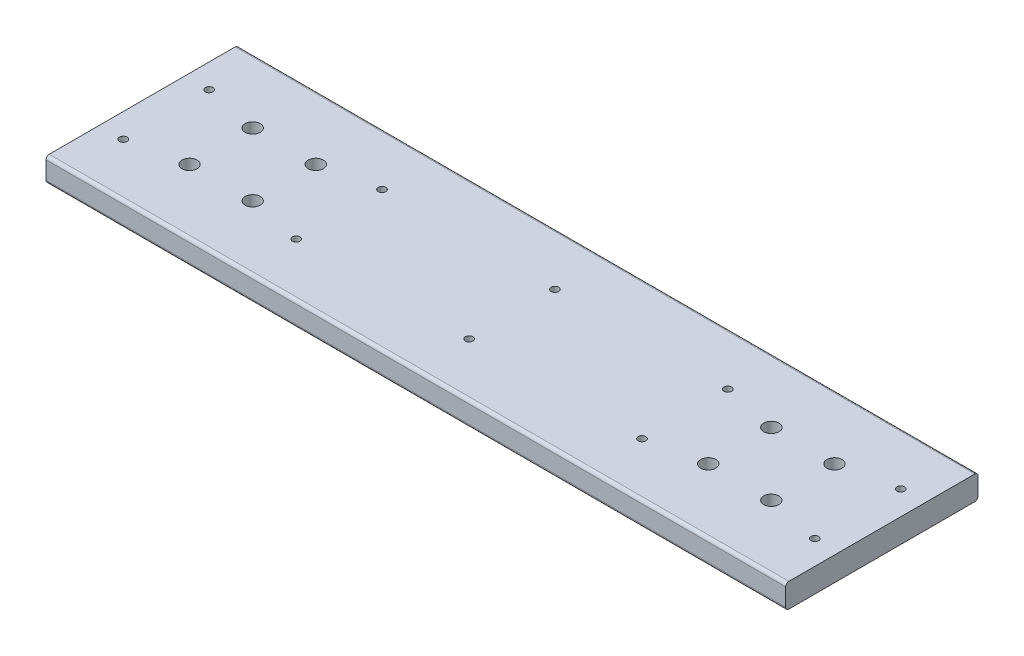
ISO-10303-21;
HEADER;
FILE_DESCRIPTION(('STEP AP214'),'2;1');
FILE_NAME('part.step','',(''),(''),'','','');
FILE_SCHEMA(('AUTOMOTIVE_DESIGN { 1 0 10303 214 1 1 1 1 }'));
ENDSEC;
DATA;
#1=APPLICATION_CONTEXT('core data for automotive mechanical design processes');
#2=APPLICATION_PROTOCOL_DEFINITION('international standard','automotive_design',2000,#1);
#3=PRODUCT_CONTEXT('',#1,'mechanical');
#4=PRODUCT('Part','Part','',(#3));
#5=PRODUCT_RELATED_PRODUCT_CATEGORY('part','',(#4));
#6=PRODUCT_DEFINITION_FORMATION('','',#4);
#7=PRODUCT_DEFINITION_CONTEXT('part definition',#1,'design');
#8=PRODUCT_DEFINITION('design','',#6,#7);
#9=PRODUCT_DEFINITION_SHAPE('','',#8);
#10=(LENGTH_UNIT() NAMED_UNIT(*) SI_UNIT(.MILLI.,.METRE.));
#11=(NAMED_UNIT(*) PLANE_ANGLE_UNIT() SI_UNIT($,.RADIAN.));
#12=(NAMED_UNIT(*) SI_UNIT($,.STERADIAN.) SOLID_ANGLE_UNIT());
#13=UNCERTAINTY_MEASURE_WITH_UNIT(LENGTH_MEASURE(1.E-05),#10,'distance_accuracy_value','');
#14=(GEOMETRIC_REPRESENTATION_CONTEXT(3) GLOBAL_UNCERTAINTY_ASSIGNED_CONTEXT((#13)) GLOBAL_UNIT_ASSIGNED_CONTEXT((#10,
#11,#12)) REPRESENTATION_CONTEXT('',''));
#15=CARTESIAN_POINT('',(0.,0.,0.));
#16=DIRECTION('',(0.,0.,1.));
#17=DIRECTION('',(1.,0.,0.));
#18=AXIS2_PLACEMENT_3D('',#15,#16,#17);
#19=CARTESIAN_POINT('',(146.524999939,9.52500000000001,38.1));
#20=DIRECTION('',(0.,-1.,0.));
#21=DIRECTION('',(0.,0.,-1.));
#22=AXIS2_PLACEMENT_3D('',#19,#20,#21);
#23=PLANE('',#22);
#24=CARTESIAN_POINT('',(-115.249999999997,9.52500000000001,-12.5));
#25=DIRECTION('',(0.,1.,0.));
#26=DIRECTION('',(0.,0.,1.));
#27=AXIS2_PLACEMENT_3D('',#24,#25,#26);
#28=CIRCLE('',#27,3.);
#29=CARTESIAN_POINT('',(-115.249999999997,9.52500000000001,-9.5));
#30=VERTEX_POINT('',#29);
#31=EDGE_CURVE('E356',#30,#30,#28,.T.);
#32=ORIENTED_EDGE('',*,*,#31,.F.);
#33=EDGE_LOOP('',(#32));
#34=FACE_BOUND('',#33,.T.);
#35=CARTESIAN_POINT('',(-90.2499999999973,9.52500000000001,12.5));
#36=DIRECTION('',(0.,1.,0.));
#37=DIRECTION('',(0.,0.,1.));
#38=AXIS2_PLACEMENT_3D('',#35,#36,#37);
#39=CIRCLE('',#38,3.);
#40=CARTESIAN_POINT('',(-90.2499999999973,9.52500000000001,15.5));
#41=VERTEX_POINT('',#40);
#42=EDGE_CURVE('E332',#41,#41,#39,.T.);
#43=ORIENTED_EDGE('',*,*,#42,.F.);
#44=EDGE_LOOP('',(#43));
#45=FACE_BOUND('',#44,.T.);
#46=CARTESIAN_POINT('',(90.2500000000081,9.52500000000001,-12.5));
#47=DIRECTION('',(0.,1.,0.));
#48=DIRECTION('',(0.,0.,1.));
#49=AXIS2_PLACEMENT_3D('',#46,#47,#48);
#50=CIRCLE('',#49,3.);
#51=CARTESIAN_POINT('',(90.2500000000081,9.52500000000001,-9.5));
#52=VERTEX_POINT('',#51);
#53=EDGE_CURVE('E324',#52,#52,#50,.T.);
#54=ORIENTED_EDGE('',*,*,#53,.F.);
#55=EDGE_LOOP('',(#54));
#56=FACE_BOUND('',#55,.T.);
#57=CARTESIAN_POINT('',(90.2500000000081,9.52500000000001,12.5));
#58=DIRECTION('',(0.,1.,0.));
#59=DIRECTION('',(0.,0.,1.));
#60=AXIS2_PLACEMENT_3D('',#57,#58,#59);
#61=CIRCLE('',#60,3.);
#62=CARTESIAN_POINT('',(90.2500000000081,9.52500000000001,15.5));
#63=VERTEX_POINT('',#62);
#64=EDGE_CURVE('E316',#63,#63,#61,.T.);
#65=ORIENTED_EDGE('',*,*,#64,.F.);
#66=EDGE_LOOP('',(#65));
#67=FACE_BOUND('',#66,.T.);
#68=CARTESIAN_POINT('',(115.250000000008,9.52500000000001,-12.5));
#69=DIRECTION('',(0.,1.,0.));
#70=DIRECTION('',(0.,0.,1.));
#71=AXIS2_PLACEMENT_3D('',#68,#69,#70);
#72=CIRCLE('',#71,3.);
#73=CARTESIAN_POINT('',(115.250000000008,9.52500000000001,-9.5));
#74=VERTEX_POINT('',#73);
#75=EDGE_CURVE('E308',#74,#74,#72,.T.);
#76=ORIENTED_EDGE('',*,*,#75,.F.);
#77=EDGE_LOOP('',(#76));
#78=FACE_BOUND('',#77,.T.);
#79=CARTESIAN_POINT('',(115.250000000008,9.52500000000001,12.5));
#80=DIRECTION('',(0.,1.,0.));
#81=DIRECTION('',(0.,0.,1.));
#82=AXIS2_PLACEMENT_3D('',#79,#80,#81);
#83=CIRCLE('',#82,3.);
#84=CARTESIAN_POINT('',(115.250000000008,9.52500000000001,15.5));
#85=VERTEX_POINT('',#84);
#86=EDGE_CURVE('E300',#85,#85,#83,.T.);
#87=ORIENTED_EDGE('',*,*,#86,.F.);
#88=EDGE_LOOP('',(#87));
#89=FACE_BOUND('',#88,.T.);
#90=CARTESIAN_POINT('',(-137.,9.52500000000001,-17.000000036));
#91=DIRECTION('',(0.,1.,0.));
#92=DIRECTION('',(0.,0.,1.));
#93=AXIS2_PLACEMENT_3D('',#90,#91,#92);
#94=CIRCLE('',#93,1.5);
#95=CARTESIAN_POINT('',(-137.,9.52500000000001,-15.500000036));
#96=VERTEX_POINT('',#95);
#97=EDGE_CURVE('E292',#96,#96,#94,.T.);
#98=ORIENTED_EDGE('',*,*,#97,.F.);
#99=EDGE_LOOP('',(#98));
#100=FACE_BOUND('',#99,.T.);
#101=CARTESIAN_POINT('',(-137.,9.52500000000001,17.000000036));
#102=DIRECTION('',(0.,1.,0.));
#103=DIRECTION('',(0.,0.,1.));
#104=AXIS2_PLACEMENT_3D('',#101,#102,#103);
#105=CIRCLE('',#104,1.5);
#106=CARTESIAN_POINT('',(-137.,9.52500000000001,18.500000036));
#107=VERTEX_POINT('',#106);
#108=EDGE_CURVE('E284',#107,#107,#105,.T.);
#109=ORIENTED_EDGE('',*,*,#108,.F.);
#110=EDGE_LOOP('',(#109));
#111=FACE_BOUND('',#110,.T.);
#112=CARTESIAN_POINT('',(-68.4999999999946,9.52500000000001,-17.000000036));
#113=DIRECTION('',(0.,1.,0.));
#114=DIRECTION('',(0.,0.,1.));
#115=AXIS2_PLACEMENT_3D('',#112,#113,#114);
#116=CIRCLE('',#115,1.5);
#117=CARTESIAN_POINT('',(-68.4999999999946,9.52500000000001,-15.500000036));
#118=VERTEX_POINT('',#117);
#119=EDGE_CURVE('E276',#118,#118,#116,.T.);
#120=ORIENTED_EDGE('',*,*,#119,.F.);
#121=EDGE_LOOP('',(#120));
#122=FACE_BOUND('',#121,.T.);
#123=CARTESIAN_POINT('',(-68.4999999999946,9.52500000000001,17.000000036));
#124=DIRECTION('',(0.,1.,0.));
#125=DIRECTION('',(0.,0.,1.));
#126=AXIS2_PLACEMENT_3D('',#123,#124,#125);
#127=CIRCLE('',#126,1.5);
#128=CARTESIAN_POINT('',(-68.4999999999946,9.52500000000001,18.500000036));
#129=VERTEX_POINT('',#128);
#130=EDGE_CURVE('E268',#129,#129,#127,.T.);
#131=ORIENTED_EDGE('',*,*,#130,.F.);
#132=EDGE_LOOP('',(#131));
#133=FACE_BOUND('',#132,.T.);
#134=CARTESIAN_POINT('',(0.,9.52500000000001,-17.000000036));
#135=DIRECTION('',(0.,1.,0.));
#136=DIRECTION('',(0.,0.,1.));
#137=AXIS2_PLACEMENT_3D('',#134,#135,#136);
#138=CIRCLE('',#137,1.5);
#139=CARTESIAN_POINT('',(0.,9.52500000000001,-15.500000036));
#140=VERTEX_POINT('',#139);
#141=EDGE_CURVE('E260',#140,#140,#138,.T.);
#142=ORIENTED_EDGE('',*,*,#141,.F.);
#143=EDGE_LOOP('',(#142));
#144=FACE_BOUND('',#143,.T.);
#145=CARTESIAN_POINT('',(0.,9.52500000000001,17.000000036));
#146=DIRECTION('',(0.,1.,0.));
#147=DIRECTION('',(0.,0.,1.));
#148=AXIS2_PLACEMENT_3D('',#145,#146,#147);
#149=CIRCLE('',#148,1.5);
#150=CARTESIAN_POINT('',(0.,9.52500000000001,18.500000036));
#151=VERTEX_POINT('',#150);
#152=EDGE_CURVE('E252',#151,#151,#149,.T.);
#153=ORIENTED_EDGE('',*,*,#152,.F.);
#154=EDGE_LOOP('',(#153));
#155=FACE_BOUND('',#154,.T.);
#156=CARTESIAN_POINT('',(68.5000000000054,9.52500000000001,-17.000000036));
#157=DIRECTION('',(0.,1.,0.));
#158=DIRECTION('',(0.,0.,1.));
#159=AXIS2_PLACEMENT_3D('',#156,#157,#158);
#160=CIRCLE('',#159,1.5);
#161=CARTESIAN_POINT('',(68.5000000000054,9.52500000000001,-15.500000036));
#162=VERTEX_POINT('',#161);
#163=EDGE_CURVE('E244',#162,#162,#160,.T.);
#164=ORIENTED_EDGE('',*,*,#163,.F.);
#165=EDGE_LOOP('',(#164));
#166=FACE_BOUND('',#165,.T.);
#167=CARTESIAN_POINT('',(68.5000000000054,9.52500000000001,17.000000036));
#168=DIRECTION('',(0.,1.,0.));
#169=DIRECTION('',(0.,0.,1.));
#170=AXIS2_PLACEMENT_3D('',#167,#168,#169);
#171=CIRCLE('',#170,1.5);
#172=CARTESIAN_POINT('',(68.5000000000054,9.52500000000001,18.500000036));
#173=VERTEX_POINT('',#172);
#174=EDGE_CURVE('E236',#173,#173,#171,.T.);
#175=ORIENTED_EDGE('',*,*,#174,.F.);
#176=EDGE_LOOP('',(#175));
#177=FACE_BOUND('',#176,.T.);
#178=CARTESIAN_POINT('',(137.000000000011,9.52500000000001,-17.000000036));
#179=DIRECTION('',(0.,1.,0.));
#180=DIRECTION('',(0.,0.,1.));
#181=AXIS2_PLACEMENT_3D('',#178,#179,#180);
#182=CIRCLE('',#181,1.5);
#183=CARTESIAN_POINT('',(137.000000000011,9.52500000000001,-15.500000036));
#184=VERTEX_POINT('',#183);
#185=EDGE_CURVE('E228',#184,#184,#182,.T.);
#186=ORIENTED_EDGE('',*,*,#185,.F.);
#187=EDGE_LOOP('',(#186));
#188=FACE_BOUND('',#187,.T.);
#189=CARTESIAN_POINT('',(137.000000000011,9.52500000000001,17.000000036));
#190=DIRECTION('',(0.,1.,0.));
#191=DIRECTION('',(0.,0.,1.));
#192=AXIS2_PLACEMENT_3D('',#189,#190,#191);
#193=CIRCLE('',#192,1.5);
#194=CARTESIAN_POINT('',(137.000000000011,9.52500000000001,18.500000036));
#195=VERTEX_POINT('',#194);
#196=EDGE_CURVE('E212',#195,#195,#193,.T.);
#197=ORIENTED_EDGE('',*,*,#196,.F.);
#198=EDGE_LOOP('',(#197));
#199=FACE_BOUND('',#198,.T.);
#200=DIRECTION('',(0.,0.,1.));
#201=VECTOR('',#200,1.);
#202=CARTESIAN_POINT('',(146.524999939,9.52500000000001,38.1));
#203=LINE('',#202,#201);
#204=CARTESIAN_POINT('',(146.524999939,9.52500000000001,-36.83));
#205=VERTEX_POINT('',#204);
#206=CARTESIAN_POINT('',(146.524999939,9.52500000000001,36.83));
#207=VERTEX_POINT('',#206);
#208=EDGE_CURVE('E157',#205,#207,#203,.T.);
#209=ORIENTED_EDGE('',*,*,#208,.F.);
#210=DIRECTION('',(-1.,0.,0.));
#211=VECTOR('',#210,1.);
#212=CARTESIAN_POINT('',(146.524999939,9.52500000000001,-36.83));
#213=LINE('',#212,#211);
#214=CARTESIAN_POINT('',(-146.524999939,9.52500000000001,-36.83));
#215=VERTEX_POINT('',#214);
#216=EDGE_CURVE('E184',#205,#215,#213,.T.);
#217=ORIENTED_EDGE('',*,*,#216,.T.);
#218=DIRECTION('',(0.,0.,1.));
#219=VECTOR('',#218,1.);
#220=CARTESIAN_POINT('',(-146.524999939,9.52500000000001,38.1));
#221=LINE('',#220,#219);
#222=CARTESIAN_POINT('',(-146.524999939,9.52500000000001,36.83));
#223=VERTEX_POINT('',#222);
#224=EDGE_CURVE('E145',#215,#223,#221,.T.);
#225=ORIENTED_EDGE('',*,*,#224,.T.);
#226=DIRECTION('',(-1.,0.,0.));
#227=VECTOR('',#226,1.);
#228=CARTESIAN_POINT('',(146.524999939,9.52500000000001,36.83));
#229=LINE('',#228,#227);
#230=EDGE_CURVE('E65',#223,#207,#229,.F.);
#231=ORIENTED_EDGE('',*,*,#230,.T.);
#232=EDGE_LOOP('',(#209,#217,#225,#231));
#233=FACE_BOUND('',#232,.T.);
#234=CARTESIAN_POINT('',(-90.2499999999973,9.52500000000001,-12.5));
#235=DIRECTION('',(0.,1.,0.));
#236=DIRECTION('',(0.,0.,1.));
#237=AXIS2_PLACEMENT_3D('',#234,#235,#236);
#238=CIRCLE('',#237,3.);
#239=CARTESIAN_POINT('',(-90.2499999999973,9.52500000000001,-9.5));
#240=VERTEX_POINT('',#239);
#241=EDGE_CURVE('E340',#240,#240,#238,.T.);
#242=ORIENTED_EDGE('',*,*,#241,.F.);
#243=EDGE_LOOP('',(#242));
#244=FACE_BOUND('',#243,.T.);
#245=CARTESIAN_POINT('',(-115.249999999997,9.52500000000001,12.5));
#246=DIRECTION('',(0.,1.,0.));
#247=DIRECTION('',(0.,0.,1.));
#248=AXIS2_PLACEMENT_3D('',#245,#246,#247);
#249=CIRCLE('',#248,3.);
#250=CARTESIAN_POINT('',(-115.249999999997,9.52500000000001,15.5));
#251=VERTEX_POINT('',#250);
#252=EDGE_CURVE('E348',#251,#251,#249,.T.);
#253=ORIENTED_EDGE('',*,*,#252,.F.);
#254=EDGE_LOOP('',(#253));
#255=FACE_BOUND('',#254,.T.);
#256=ADVANCED_FACE('F49',(#34,#45,#56,#67,#78,#89,#100,#111,#122,#133,#144,#155,#166,#177,#188,
#199,#233,#244,#255),#23,.F.);
#257=CARTESIAN_POINT('',(146.524999939,9.52500000000001,38.1));
#258=DIRECTION('',(0.,0.,-1.));
#259=DIRECTION('',(0.,1.,0.));
#260=AXIS2_PLACEMENT_3D('',#257,#258,#259);
#261=PLANE('',#260);
#262=DIRECTION('',(0.,-1.,0.));
#263=VECTOR('',#262,1.);
#264=CARTESIAN_POINT('',(146.524999939,9.52500000000001,38.1));
#265=LINE('',#264,#263);
#266=CARTESIAN_POINT('',(146.524999939,8.25500000000001,38.1));
#267=VERTEX_POINT('',#266);
#268=CARTESIAN_POINT('',(146.524999939,1.27000000000001,38.1));
#269=VERTEX_POINT('',#268);
#270=EDGE_CURVE('E150',#267,#269,#265,.T.);
#271=ORIENTED_EDGE('',*,*,#270,.F.);
#272=DIRECTION('',(-1.,0.,0.));
#273=VECTOR('',#272,1.);
#274=CARTESIAN_POINT('',(146.524999939,8.25500000000001,38.1));
#275=LINE('',#274,#273);
#276=CARTESIAN_POINT('',(-146.524999939,8.25500000000001,38.1));
#277=VERTEX_POINT('',#276);
#278=EDGE_CURVE('E11',#267,#277,#275,.T.);
#279=ORIENTED_EDGE('',*,*,#278,.T.);
#280=DIRECTION('',(0.,-1.,0.));
#281=VECTOR('',#280,1.);
#282=CARTESIAN_POINT('',(-146.524999939,9.52500000000001,38.1));
#283=LINE('',#282,#281);
#284=CARTESIAN_POINT('',(-146.524999939,1.27000000000001,38.1));
#285=VERTEX_POINT('',#284);
#286=EDGE_CURVE('E152',#277,#285,#283,.T.);
#287=ORIENTED_EDGE('',*,*,#286,.T.);
#288=DIRECTION('',(-1.,0.,0.));
#289=VECTOR('',#288,1.);
#290=CARTESIAN_POINT('',(146.524999939,1.27000000000001,38.1));
#291=LINE('',#290,#289);
#292=EDGE_CURVE('E58',#285,#269,#291,.F.);
#293=ORIENTED_EDGE('',*,*,#292,.T.);
#294=EDGE_LOOP('',(#271,#279,#287,#293));
#295=FACE_BOUND('',#294,.T.);
#296=ADVANCED_FACE('F193',(#295),#261,.F.);
#297=CARTESIAN_POINT('',(146.524999939,0.,38.1));
#298=DIRECTION('',(0.,1.,0.));
#299=DIRECTION('',(0.,0.,1.));
#300=AXIS2_PLACEMENT_3D('',#297,#298,#299);
#301=PLANE('',#300);
#302=CARTESIAN_POINT('',(-115.249999999997,0.,-12.5));
#303=DIRECTION('',(0.,1.,0.));
#304=DIRECTION('',(0.,0.,1.));
#305=AXIS2_PLACEMENT_3D('',#302,#303,#304);
#306=CIRCLE('',#305,3.);
#307=CARTESIAN_POINT('',(-115.249999999997,0.,-9.5));
#308=VERTEX_POINT('',#307);
#309=EDGE_CURVE('E352',#308,#308,#306,.T.);
#310=ORIENTED_EDGE('',*,*,#309,.T.);
#311=EDGE_LOOP('',(#310));
#312=FACE_BOUND('',#311,.T.);
#313=CARTESIAN_POINT('',(-115.249999999997,0.,12.5));
#314=DIRECTION('',(0.,1.,0.));
#315=DIRECTION('',(0.,0.,1.));
#316=AXIS2_PLACEMENT_3D('',#313,#314,#315);
#317=CIRCLE('',#316,3.);
#318=CARTESIAN_POINT('',(-115.249999999997,0.,15.5));
#319=VERTEX_POINT('',#318);
#320=EDGE_CURVE('E344',#319,#319,#317,.T.);
#321=ORIENTED_EDGE('',*,*,#320,.T.);
#322=EDGE_LOOP('',(#321));
#323=FACE_BOUND('',#322,.T.);
#324=CARTESIAN_POINT('',(-90.2499999999973,0.,-12.5));
#325=DIRECTION('',(0.,1.,0.));
#326=DIRECTION('',(0.,0.,1.));
#327=AXIS2_PLACEMENT_3D('',#324,#325,#326);
#328=CIRCLE('',#327,3.);
#329=CARTESIAN_POINT('',(-90.2499999999973,0.,-9.5));
#330=VERTEX_POINT('',#329);
#331=EDGE_CURVE('E336',#330,#330,#328,.T.);
#332=ORIENTED_EDGE('',*,*,#331,.T.);
#333=EDGE_LOOP('',(#332));
#334=FACE_BOUND('',#333,.T.);
#335=CARTESIAN_POINT('',(-90.2499999999973,0.,12.5));
#336=DIRECTION('',(0.,1.,0.));
#337=DIRECTION('',(0.,0.,1.));
#338=AXIS2_PLACEMENT_3D('',#335,#336,#337);
#339=CIRCLE('',#338,3.);
#340=CARTESIAN_POINT('',(-90.2499999999973,0.,15.5));
#341=VERTEX_POINT('',#340);
#342=EDGE_CURVE('E328',#341,#341,#339,.T.);
#343=ORIENTED_EDGE('',*,*,#342,.T.);
#344=EDGE_LOOP('',(#343));
#345=FACE_BOUND('',#344,.T.);
#346=CARTESIAN_POINT('',(90.2500000000081,0.,-12.5));
#347=DIRECTION('',(0.,1.,0.));
#348=DIRECTION('',(0.,0.,1.));
#349=AXIS2_PLACEMENT_3D('',#346,#347,#348);
#350=CIRCLE('',#349,3.);
#351=CARTESIAN_POINT('',(90.2500000000081,0.,-9.5));
#352=VERTEX_POINT('',#351);
#353=EDGE_CURVE('E320',#352,#352,#350,.T.);
#354=ORIENTED_EDGE('',*,*,#353,.T.);
#355=EDGE_LOOP('',(#354));
#356=FACE_BOUND('',#355,.T.);
#357=CARTESIAN_POINT('',(90.2500000000081,0.,12.5));
#358=DIRECTION('',(0.,1.,0.));
#359=DIRECTION('',(0.,0.,1.));
#360=AXIS2_PLACEMENT_3D('',#357,#358,#359);
#361=CIRCLE('',#360,3.);
#362=CARTESIAN_POINT('',(90.2500000000081,0.,15.5));
#363=VERTEX_POINT('',#362);
#364=EDGE_CURVE('E312',#363,#363,#361,.T.);
#365=ORIENTED_EDGE('',*,*,#364,.T.);
#366=EDGE_LOOP('',(#365));
#367=FACE_BOUND('',#366,.T.);
#368=CARTESIAN_POINT('',(115.250000000008,0.,-12.5));
#369=DIRECTION('',(0.,1.,0.));
#370=DIRECTION('',(0.,0.,1.));
#371=AXIS2_PLACEMENT_3D('',#368,#369,#370);
#372=CIRCLE('',#371,3.);
#373=CARTESIAN_POINT('',(115.250000000008,0.,-9.5));
#374=VERTEX_POINT('',#373);
#375=EDGE_CURVE('E304',#374,#374,#372,.T.);
#376=ORIENTED_EDGE('',*,*,#375,.T.);
#377=EDGE_LOOP('',(#376));
#378=FACE_BOUND('',#377,.T.);
#379=CARTESIAN_POINT('',(115.250000000008,0.,12.5));
#380=DIRECTION('',(0.,1.,0.));
#381=DIRECTION('',(0.,0.,1.));
#382=AXIS2_PLACEMENT_3D('',#379,#380,#381);
#383=CIRCLE('',#382,3.);
#384=CARTESIAN_POINT('',(115.250000000008,0.,15.5));
#385=VERTEX_POINT('',#384);
#386=EDGE_CURVE('E296',#385,#385,#383,.T.);
#387=ORIENTED_EDGE('',*,*,#386,.T.);
#388=EDGE_LOOP('',(#387));
#389=FACE_BOUND('',#388,.T.);
#390=CARTESIAN_POINT('',(-137.,0.,-17.000000036));
#391=DIRECTION('',(0.,1.,0.));
#392=DIRECTION('',(0.,0.,1.));
#393=AXIS2_PLACEMENT_3D('',#390,#391,#392);
#394=CIRCLE('',#393,1.5);
#395=CARTESIAN_POINT('',(-137.,0.,-15.500000036));
#396=VERTEX_POINT('',#395);
#397=EDGE_CURVE('E288',#396,#396,#394,.T.);
#398=ORIENTED_EDGE('',*,*,#397,.T.);
#399=EDGE_LOOP('',(#398));
#400=FACE_BOUND('',#399,.T.);
#401=CARTESIAN_POINT('',(-137.,0.,17.000000036));
#402=DIRECTION('',(0.,1.,0.));
#403=DIRECTION('',(0.,0.,1.));
#404=AXIS2_PLACEMENT_3D('',#401,#402,#403);
#405=CIRCLE('',#404,1.5);
#406=CARTESIAN_POINT('',(-137.,0.,18.500000036));
#407=VERTEX_POINT('',#406);
#408=EDGE_CURVE('E280',#407,#407,#405,.T.);
#409=ORIENTED_EDGE('',*,*,#408,.T.);
#410=EDGE_LOOP('',(#409));
#411=FACE_BOUND('',#410,.T.);
#412=CARTESIAN_POINT('',(-68.4999999999946,0.,-17.000000036));
#413=DIRECTION('',(0.,1.,0.));
#414=DIRECTION('',(0.,0.,1.));
#415=AXIS2_PLACEMENT_3D('',#412,#413,#414);
#416=CIRCLE('',#415,1.5);
#417=CARTESIAN_POINT('',(-68.4999999999946,0.,-15.500000036));
#418=VERTEX_POINT('',#417);
#419=EDGE_CURVE('E272',#418,#418,#416,.T.);
#420=ORIENTED_EDGE('',*,*,#419,.T.);
#421=EDGE_LOOP('',(#420));
#422=FACE_BOUND('',#421,.T.);
#423=CARTESIAN_POINT('',(-68.4999999999946,0.,17.000000036));
#424=DIRECTION('',(0.,1.,0.));
#425=DIRECTION('',(0.,0.,1.));
#426=AXIS2_PLACEMENT_3D('',#423,#424,#425);
#427=CIRCLE('',#426,1.5);
#428=CARTESIAN_POINT('',(-68.4999999999946,0.,18.500000036));
#429=VERTEX_POINT('',#428);
#430=EDGE_CURVE('E264',#429,#429,#427,.T.);
#431=ORIENTED_EDGE('',*,*,#430,.T.);
#432=EDGE_LOOP('',(#431));
#433=FACE_BOUND('',#432,.T.);
#434=CARTESIAN_POINT('',(0.,0.,-17.000000036));
#435=DIRECTION('',(0.,1.,0.));
#436=DIRECTION('',(0.,0.,1.));
#437=AXIS2_PLACEMENT_3D('',#434,#435,#436);
#438=CIRCLE('',#437,1.5);
#439=CARTESIAN_POINT('',(0.,0.,-15.500000036));
#440=VERTEX_POINT('',#439);
#441=EDGE_CURVE('E256',#440,#440,#438,.T.);
#442=ORIENTED_EDGE('',*,*,#441,.T.);
#443=EDGE_LOOP('',(#442));
#444=FACE_BOUND('',#443,.T.);
#445=CARTESIAN_POINT('',(0.,0.,17.000000036));
#446=DIRECTION('',(0.,1.,0.));
#447=DIRECTION('',(0.,0.,1.));
#448=AXIS2_PLACEMENT_3D('',#445,#446,#447);
#449=CIRCLE('',#448,1.5);
#450=CARTESIAN_POINT('',(0.,0.,18.500000036));
#451=VERTEX_POINT('',#450);
#452=EDGE_CURVE('E248',#451,#451,#449,.T.);
#453=ORIENTED_EDGE('',*,*,#452,.T.);
#454=EDGE_LOOP('',(#453));
#455=FACE_BOUND('',#454,.T.);
#456=CARTESIAN_POINT('',(68.5000000000054,0.,-17.000000036));
#457=DIRECTION('',(0.,1.,0.));
#458=DIRECTION('',(0.,0.,1.));
#459=AXIS2_PLACEMENT_3D('',#456,#457,#458);
#460=CIRCLE('',#459,1.5);
#461=CARTESIAN_POINT('',(68.5000000000054,0.,-15.500000036));
#462=VERTEX_POINT('',#461);
#463=EDGE_CURVE('E240',#462,#462,#460,.T.);
#464=ORIENTED_EDGE('',*,*,#463,.T.);
#465=EDGE_LOOP('',(#464));
#466=FACE_BOUND('',#465,.T.);
#467=CARTESIAN_POINT('',(68.5000000000054,0.,17.000000036));
#468=DIRECTION('',(0.,1.,0.));
#469=DIRECTION('',(0.,0.,1.));
#470=AXIS2_PLACEMENT_3D('',#467,#468,#469);
#471=CIRCLE('',#470,1.5);
#472=CARTESIAN_POINT('',(68.5000000000054,0.,18.500000036));
#473=VERTEX_POINT('',#472);
#474=EDGE_CURVE('E232',#473,#473,#471,.T.);
#475=ORIENTED_EDGE('',*,*,#474,.T.);
#476=EDGE_LOOP('',(#475));
#477=FACE_BOUND('',#476,.T.);
#478=CARTESIAN_POINT('',(137.000000000011,0.,-17.000000036));
#479=DIRECTION('',(0.,1.,0.));
#480=DIRECTION('',(0.,0.,1.));
#481=AXIS2_PLACEMENT_3D('',#478,#479,#480);
#482=CIRCLE('',#481,1.5);
#483=CARTESIAN_POINT('',(137.000000000011,0.,-15.500000036));
#484=VERTEX_POINT('',#483);
#485=EDGE_CURVE('E224',#484,#484,#482,.T.);
#486=ORIENTED_EDGE('',*,*,#485,.T.);
#487=EDGE_LOOP('',(#486));
#488=FACE_BOUND('',#487,.T.);
#489=CARTESIAN_POINT('',(137.000000000011,0.,17.000000036));
#490=DIRECTION('',(0.,1.,0.));
#491=DIRECTION('',(0.,0.,1.));
#492=AXIS2_PLACEMENT_3D('',#489,#490,#491);
#493=CIRCLE('',#492,1.5);
#494=CARTESIAN_POINT('',(137.000000000011,0.,18.500000036));
#495=VERTEX_POINT('',#494);
#496=EDGE_CURVE('E209',#495,#495,#493,.T.);
#497=ORIENTED_EDGE('',*,*,#496,.T.);
#498=EDGE_LOOP('',(#497));
#499=FACE_BOUND('',#498,.T.);
#500=DIRECTION('',(0.,0.,-1.));
#501=VECTOR('',#500,1.);
#502=CARTESIAN_POINT('',(-146.524999939,0.,38.1));
#503=LINE('',#502,#501);
#504=CARTESIAN_POINT('',(-146.524999939,0.,36.83));
#505=VERTEX_POINT('',#504);
#506=CARTESIAN_POINT('',(-146.524999939,0.,-36.83));
#507=VERTEX_POINT('',#506);
#508=EDGE_CURVE('E146',#505,#507,#503,.T.);
#509=ORIENTED_EDGE('',*,*,#508,.T.);
#510=DIRECTION('',(-1.,0.,0.));
#511=VECTOR('',#510,1.);
#512=CARTESIAN_POINT('',(146.524999939,0.,-36.83));
#513=LINE('',#512,#511);
#514=CARTESIAN_POINT('',(146.524999939,0.,-36.83));
#515=VERTEX_POINT('',#514);
#516=EDGE_CURVE('E122',#507,#515,#513,.F.);
#517=ORIENTED_EDGE('',*,*,#516,.T.);
#518=DIRECTION('',(0.,0.,-1.));
#519=VECTOR('',#518,1.);
#520=CARTESIAN_POINT('',(146.524999939,0.,38.1));
#521=LINE('',#520,#519);
#522=CARTESIAN_POINT('',(146.524999939,0.,36.83));
#523=VERTEX_POINT('',#522);
#524=EDGE_CURVE('E203',#523,#515,#521,.T.);
#525=ORIENTED_EDGE('',*,*,#524,.F.);
#526=DIRECTION('',(-1.,0.,0.));
#527=VECTOR('',#526,1.);
#528=CARTESIAN_POINT('',(146.524999939,0.,36.83));
#529=LINE('',#528,#527);
#530=EDGE_CURVE('E128',#523,#505,#529,.T.);
#531=ORIENTED_EDGE('',*,*,#530,.T.);
#532=EDGE_LOOP('',(#509,#517,#525,#531));
#533=FACE_BOUND('',#532,.T.);
#534=ADVANCED_FACE('F207',(#312,#323,#334,#345,#356,#367,#378,#389,#400,#411,#422,#433,#444,
#455,#466,#477,#488,#499,#533),#301,.F.);
#535=CARTESIAN_POINT('',(146.524999939,9.52500000000001,-38.1));
#536=DIRECTION('',(0.,0.,1.));
#537=DIRECTION('',(0.,-1.,0.));
#538=AXIS2_PLACEMENT_3D('',#535,#536,#537);
#539=PLANE('',#538);
#540=DIRECTION('',(0.,1.,0.));
#541=VECTOR('',#540,1.);
#542=CARTESIAN_POINT('',(146.524999939,9.52500000000001,-38.1));
#543=LINE('',#542,#541);
#544=CARTESIAN_POINT('',(146.524999939,1.27000000000001,-38.1));
#545=VERTEX_POINT('',#544);
#546=CARTESIAN_POINT('',(146.524999939,8.25500000000001,-38.1));
#547=VERTEX_POINT('',#546);
#548=EDGE_CURVE('E137',#545,#547,#543,.T.);
#549=ORIENTED_EDGE('',*,*,#548,.F.);
#550=DIRECTION('',(-1.,0.,0.));
#551=VECTOR('',#550,1.);
#552=CARTESIAN_POINT('',(146.524999939,1.27000000000001,-38.1));
#553=LINE('',#552,#551);
#554=CARTESIAN_POINT('',(-146.524999939,1.27000000000001,-38.1));
#555=VERTEX_POINT('',#554);
#556=EDGE_CURVE('E121',#545,#555,#553,.T.);
#557=ORIENTED_EDGE('',*,*,#556,.T.);
#558=DIRECTION('',(0.,1.,0.));
#559=VECTOR('',#558,1.);
#560=CARTESIAN_POINT('',(-146.524999939,9.52500000000001,-38.1));
#561=LINE('',#560,#559);
#562=CARTESIAN_POINT('',(-146.524999939,8.25500000000001,-38.1));
#563=VERTEX_POINT('',#562);
#564=EDGE_CURVE('E135',#555,#563,#561,.T.);
#565=ORIENTED_EDGE('',*,*,#564,.T.);
#566=DIRECTION('',(-1.,0.,0.));
#567=VECTOR('',#566,1.);
#568=CARTESIAN_POINT('',(146.524999939,8.25500000000001,-38.1));
#569=LINE('',#568,#567);
#570=EDGE_CURVE('E140',#563,#547,#569,.F.);
#571=ORIENTED_EDGE('',*,*,#570,.T.);
#572=EDGE_LOOP('',(#549,#557,#565,#571));
#573=FACE_BOUND('',#572,.T.);
#574=ADVANCED_FACE('F134',(#573),#539,.F.);
#575=CARTESIAN_POINT('',(146.524999939,0.,0.));
#576=DIRECTION('',(1.,0.,0.));
#577=DIRECTION('',(0.,0.,-1.));
#578=AXIS2_PLACEMENT_3D('',#575,#576,#577);
#579=PLANE('',#578);
#580=ORIENTED_EDGE('',*,*,#524,.T.);
#581=CARTESIAN_POINT('',(146.524999939,1.27000000000001,-36.83));
#582=DIRECTION('',(1.,0.,0.));
#583=DIRECTION('',(0.,0.,-1.));
#584=AXIS2_PLACEMENT_3D('',#581,#582,#583);
#585=CIRCLE('',#584,1.27);
#586=EDGE_CURVE('E179',#515,#545,#585,.T.);
#587=ORIENTED_EDGE('',*,*,#586,.T.);
#588=ORIENTED_EDGE('',*,*,#548,.T.);
#589=CARTESIAN_POINT('',(146.524999939,8.25500000000001,-36.83));
#590=DIRECTION('',(1.,0.,0.));
#591=DIRECTION('',(0.,0.,-1.));
#592=AXIS2_PLACEMENT_3D('',#589,#590,#591);
#593=CIRCLE('',#592,1.27);
#594=EDGE_CURVE('E72',#547,#205,#593,.T.);
#595=ORIENTED_EDGE('',*,*,#594,.T.);
#596=ORIENTED_EDGE('',*,*,#208,.T.);
#597=CARTESIAN_POINT('',(146.524999939,8.25500000000001,36.83));
#598=DIRECTION('',(1.,0.,0.));
#599=DIRECTION('',(0.,0.,-1.));
#600=AXIS2_PLACEMENT_3D('',#597,#598,#599);
#601=CIRCLE('',#600,1.27);
#602=EDGE_CURVE('E174',#207,#267,#601,.T.);
#603=ORIENTED_EDGE('',*,*,#602,.T.);
#604=ORIENTED_EDGE('',*,*,#270,.T.);
#605=CARTESIAN_POINT('',(146.524999939,1.27000000000001,36.83));
#606=DIRECTION('',(1.,0.,0.));
#607=DIRECTION('',(0.,0.,-1.));
#608=AXIS2_PLACEMENT_3D('',#605,#606,#607);
#609=CIRCLE('',#608,1.27);
#610=EDGE_CURVE('E171',#269,#523,#609,.T.);
#611=ORIENTED_EDGE('',*,*,#610,.T.);
#612=EDGE_LOOP('',(#580,#587,#588,#595,#596,#603,#604,#611));
#613=FACE_BOUND('',#612,.T.);
#614=ADVANCED_FACE('F199',(#613),#579,.T.);
#615=CARTESIAN_POINT('',(-146.524999939,0.,0.));
#616=DIRECTION('',(1.,0.,0.));
#617=DIRECTION('',(0.,0.,-1.));
#618=AXIS2_PLACEMENT_3D('',#615,#616,#617);
#619=PLANE('',#618);
#620=ORIENTED_EDGE('',*,*,#564,.F.);
#621=CARTESIAN_POINT('',(-146.524999939,1.27000000000001,-36.83));
#622=DIRECTION('',(1.,0.,0.));
#623=DIRECTION('',(0.,0.,-1.));
#624=AXIS2_PLACEMENT_3D('',#621,#622,#623);
#625=CIRCLE('',#624,1.27);
#626=EDGE_CURVE('E117',#555,#507,#625,.F.);
#627=ORIENTED_EDGE('',*,*,#626,.T.);
#628=ORIENTED_EDGE('',*,*,#508,.F.);
#629=CARTESIAN_POINT('',(-146.524999939,1.27000000000001,36.83));
#630=DIRECTION('',(1.,0.,0.));
#631=DIRECTION('',(0.,0.,-1.));
#632=AXIS2_PLACEMENT_3D('',#629,#630,#631);
#633=CIRCLE('',#632,1.27);
#634=EDGE_CURVE('E139',#505,#285,#633,.F.);
#635=ORIENTED_EDGE('',*,*,#634,.T.);
#636=ORIENTED_EDGE('',*,*,#286,.F.);
#637=CARTESIAN_POINT('',(-146.524999939,8.25500000000001,36.83));
#638=DIRECTION('',(1.,0.,0.));
#639=DIRECTION('',(0.,0.,-1.));
#640=AXIS2_PLACEMENT_3D('',#637,#638,#639);
#641=CIRCLE('',#640,1.27);
#642=EDGE_CURVE('E161',#277,#223,#641,.F.);
#643=ORIENTED_EDGE('',*,*,#642,.T.);
#644=ORIENTED_EDGE('',*,*,#224,.F.);
#645=CARTESIAN_POINT('',(-146.524999939,8.25500000000001,-36.83));
#646=DIRECTION('',(1.,0.,0.));
#647=DIRECTION('',(0.,0.,-1.));
#648=AXIS2_PLACEMENT_3D('',#645,#646,#647);
#649=CIRCLE('',#648,1.27);
#650=EDGE_CURVE('E129',#215,#563,#649,.F.);
#651=ORIENTED_EDGE('',*,*,#650,.T.);
#652=EDGE_LOOP('',(#620,#627,#628,#635,#636,#643,#644,#651));
#653=FACE_BOUND('',#652,.T.);
#654=ADVANCED_FACE('F142',(#653),#619,.F.);
#655=CARTESIAN_POINT('',(137.000000000011,9.52500000000001,17.000000036));
#656=DIRECTION('',(0.,1.,0.));
#657=DIRECTION('',(0.,0.,1.));
#658=AXIS2_PLACEMENT_3D('',#655,#656,#657);
#659=CYLINDRICAL_SURFACE('',#658,1.5);
#660=ORIENTED_EDGE('',*,*,#496,.F.);
#661=EDGE_LOOP('',(#660));
#662=FACE_BOUND('',#661,.T.);
#663=ORIENTED_EDGE('',*,*,#196,.T.);
#664=EDGE_LOOP('',(#663));
#665=FACE_BOUND('',#664,.T.);
#666=ADVANCED_FACE('F471',(#662,#665),#659,.F.);
#667=CARTESIAN_POINT('',(137.000000000011,9.52500000000001,-17.000000036));
#668=DIRECTION('',(0.,1.,0.));
#669=DIRECTION('',(0.,0.,1.));
#670=AXIS2_PLACEMENT_3D('',#667,#668,#669);
#671=CYLINDRICAL_SURFACE('',#670,1.5);
#672=ORIENTED_EDGE('',*,*,#485,.F.);
#673=EDGE_LOOP('',(#672));
#674=FACE_BOUND('',#673,.T.);
#675=ORIENTED_EDGE('',*,*,#185,.T.);
#676=EDGE_LOOP('',(#675));
#677=FACE_BOUND('',#676,.T.);
#678=ADVANCED_FACE('F467',(#674,#677),#671,.F.);
#679=CARTESIAN_POINT('',(68.5000000000054,9.52500000000001,17.000000036));
#680=DIRECTION('',(0.,1.,0.));
#681=DIRECTION('',(0.,0.,1.));
#682=AXIS2_PLACEMENT_3D('',#679,#680,#681);
#683=CYLINDRICAL_SURFACE('',#682,1.5);
#684=ORIENTED_EDGE('',*,*,#474,.F.);
#685=EDGE_LOOP('',(#684));
#686=FACE_BOUND('',#685,.T.);
#687=ORIENTED_EDGE('',*,*,#174,.T.);
#688=EDGE_LOOP('',(#687));
#689=FACE_BOUND('',#688,.T.);
#690=ADVANCED_FACE('F463',(#686,#689),#683,.F.);
#691=CARTESIAN_POINT('',(68.5000000000054,9.52500000000001,-17.000000036));
#692=DIRECTION('',(0.,1.,0.));
#693=DIRECTION('',(0.,0.,1.));
#694=AXIS2_PLACEMENT_3D('',#691,#692,#693);
#695=CYLINDRICAL_SURFACE('',#694,1.5);
#696=ORIENTED_EDGE('',*,*,#463,.F.);
#697=EDGE_LOOP('',(#696));
#698=FACE_BOUND('',#697,.T.);
#699=ORIENTED_EDGE('',*,*,#163,.T.);
#700=EDGE_LOOP('',(#699));
#701=FACE_BOUND('',#700,.T.);
#702=ADVANCED_FACE('F459',(#698,#701),#695,.F.);
#703=CARTESIAN_POINT('',(0.,9.52500000000001,17.000000036));
#704=DIRECTION('',(0.,1.,0.));
#705=DIRECTION('',(0.,0.,1.));
#706=AXIS2_PLACEMENT_3D('',#703,#704,#705);
#707=CYLINDRICAL_SURFACE('',#706,1.5);
#708=ORIENTED_EDGE('',*,*,#452,.F.);
#709=EDGE_LOOP('',(#708));
#710=FACE_BOUND('',#709,.T.);
#711=ORIENTED_EDGE('',*,*,#152,.T.);
#712=EDGE_LOOP('',(#711));
#713=FACE_BOUND('',#712,.T.);
#714=ADVANCED_FACE('F455',(#710,#713),#707,.F.);
#715=CARTESIAN_POINT('',(0.,9.52500000000001,-17.000000036));
#716=DIRECTION('',(0.,1.,0.));
#717=DIRECTION('',(0.,0.,1.));
#718=AXIS2_PLACEMENT_3D('',#715,#716,#717);
#719=CYLINDRICAL_SURFACE('',#718,1.5);
#720=ORIENTED_EDGE('',*,*,#441,.F.);
#721=EDGE_LOOP('',(#720));
#722=FACE_BOUND('',#721,.T.);
#723=ORIENTED_EDGE('',*,*,#141,.T.);
#724=EDGE_LOOP('',(#723));
#725=FACE_BOUND('',#724,.T.);
#726=ADVANCED_FACE('F451',(#722,#725),#719,.F.);
#727=CARTESIAN_POINT('',(-68.4999999999946,9.52500000000001,17.000000036));
#728=DIRECTION('',(0.,1.,0.));
#729=DIRECTION('',(0.,0.,1.));
#730=AXIS2_PLACEMENT_3D('',#727,#728,#729);
#731=CYLINDRICAL_SURFACE('',#730,1.5);
#732=ORIENTED_EDGE('',*,*,#430,.F.);
#733=EDGE_LOOP('',(#732));
#734=FACE_BOUND('',#733,.T.);
#735=ORIENTED_EDGE('',*,*,#130,.T.);
#736=EDGE_LOOP('',(#735));
#737=FACE_BOUND('',#736,.T.);
#738=ADVANCED_FACE('F447',(#734,#737),#731,.F.);
#739=CARTESIAN_POINT('',(-68.4999999999946,9.52500000000001,-17.000000036));
#740=DIRECTION('',(0.,1.,0.));
#741=DIRECTION('',(0.,0.,1.));
#742=AXIS2_PLACEMENT_3D('',#739,#740,#741);
#743=CYLINDRICAL_SURFACE('',#742,1.5);
#744=ORIENTED_EDGE('',*,*,#419,.F.);
#745=EDGE_LOOP('',(#744));
#746=FACE_BOUND('',#745,.T.);
#747=ORIENTED_EDGE('',*,*,#119,.T.);
#748=EDGE_LOOP('',(#747));
#749=FACE_BOUND('',#748,.T.);
#750=ADVANCED_FACE('F443',(#746,#749),#743,.F.);
#751=CARTESIAN_POINT('',(-137.,9.52500000000001,17.000000036));
#752=DIRECTION('',(0.,1.,0.));
#753=DIRECTION('',(0.,0.,1.));
#754=AXIS2_PLACEMENT_3D('',#751,#752,#753);
#755=CYLINDRICAL_SURFACE('',#754,1.5);
#756=ORIENTED_EDGE('',*,*,#408,.F.);
#757=EDGE_LOOP('',(#756));
#758=FACE_BOUND('',#757,.T.);
#759=ORIENTED_EDGE('',*,*,#108,.T.);
#760=EDGE_LOOP('',(#759));
#761=FACE_BOUND('',#760,.T.);
#762=ADVANCED_FACE('F439',(#758,#761),#755,.F.);
#763=CARTESIAN_POINT('',(-137.,9.52500000000001,-17.000000036));
#764=DIRECTION('',(0.,1.,0.));
#765=DIRECTION('',(0.,0.,1.));
#766=AXIS2_PLACEMENT_3D('',#763,#764,#765);
#767=CYLINDRICAL_SURFACE('',#766,1.5);
#768=ORIENTED_EDGE('',*,*,#397,.F.);
#769=EDGE_LOOP('',(#768));
#770=FACE_BOUND('',#769,.T.);
#771=ORIENTED_EDGE('',*,*,#97,.T.);
#772=EDGE_LOOP('',(#771));
#773=FACE_BOUND('',#772,.T.);
#774=ADVANCED_FACE('F436',(#770,#773),#767,.F.);
#775=CARTESIAN_POINT('',(146.524999939,1.27000000000001,-36.83));
#776=DIRECTION('',(-1.,0.,0.));
#777=DIRECTION('',(0.,0.,1.));
#778=AXIS2_PLACEMENT_3D('',#775,#776,#777);
#779=CYLINDRICAL_SURFACE('',#778,1.27);
#780=ORIENTED_EDGE('',*,*,#586,.F.);
#781=ORIENTED_EDGE('',*,*,#516,.F.);
#782=ORIENTED_EDGE('',*,*,#626,.F.);
#783=ORIENTED_EDGE('',*,*,#556,.F.);
#784=EDGE_LOOP('',(#780,#781,#782,#783));
#785=FACE_BOUND('',#784,.T.);
#786=ADVANCED_FACE('F120',(#785),#779,.T.);
#787=CARTESIAN_POINT('',(146.524999939,8.25500000000001,-36.83));
#788=DIRECTION('',(-1.,0.,0.));
#789=DIRECTION('',(0.,0.,1.));
#790=AXIS2_PLACEMENT_3D('',#787,#788,#789);
#791=CYLINDRICAL_SURFACE('',#790,1.27);
#792=ORIENTED_EDGE('',*,*,#594,.F.);
#793=ORIENTED_EDGE('',*,*,#570,.F.);
#794=ORIENTED_EDGE('',*,*,#650,.F.);
#795=ORIENTED_EDGE('',*,*,#216,.F.);
#796=EDGE_LOOP('',(#792,#793,#794,#795));
#797=FACE_BOUND('',#796,.T.);
#798=ADVANCED_FACE('F489',(#797),#791,.T.);
#799=CARTESIAN_POINT('',(146.524999939,8.25500000000001,36.83));
#800=DIRECTION('',(-1.,0.,0.));
#801=DIRECTION('',(0.,0.,1.));
#802=AXIS2_PLACEMENT_3D('',#799,#800,#801);
#803=CYLINDRICAL_SURFACE('',#802,1.27);
#804=ORIENTED_EDGE('',*,*,#602,.F.);
#805=ORIENTED_EDGE('',*,*,#230,.F.);
#806=ORIENTED_EDGE('',*,*,#642,.F.);
#807=ORIENTED_EDGE('',*,*,#278,.F.);
#808=EDGE_LOOP('',(#804,#805,#806,#807));
#809=FACE_BOUND('',#808,.T.);
#810=ADVANCED_FACE('F491',(#809),#803,.T.);
#811=CARTESIAN_POINT('',(146.524999939,1.27000000000001,36.83));
#812=DIRECTION('',(-1.,0.,0.));
#813=DIRECTION('',(0.,0.,1.));
#814=AXIS2_PLACEMENT_3D('',#811,#812,#813);
#815=CYLINDRICAL_SURFACE('',#814,1.27);
#816=ORIENTED_EDGE('',*,*,#610,.F.);
#817=ORIENTED_EDGE('',*,*,#292,.F.);
#818=ORIENTED_EDGE('',*,*,#634,.F.);
#819=ORIENTED_EDGE('',*,*,#530,.F.);
#820=EDGE_LOOP('',(#816,#817,#818,#819));
#821=FACE_BOUND('',#820,.T.);
#822=ADVANCED_FACE('F51',(#821),#815,.T.);
#823=CARTESIAN_POINT('',(115.250000000008,9.52500000000001,12.5));
#824=DIRECTION('',(0.,1.,0.));
#825=DIRECTION('',(0.,0.,1.));
#826=AXIS2_PLACEMENT_3D('',#823,#824,#825);
#827=CYLINDRICAL_SURFACE('',#826,3.);
#828=ORIENTED_EDGE('',*,*,#386,.F.);
#829=EDGE_LOOP('',(#828));
#830=FACE_BOUND('',#829,.T.);
#831=ORIENTED_EDGE('',*,*,#86,.T.);
#832=EDGE_LOOP('',(#831));
#833=FACE_BOUND('',#832,.T.);
#834=ADVANCED_FACE('F431',(#830,#833),#827,.F.);
#835=CARTESIAN_POINT('',(115.250000000008,9.52500000000001,-12.5));
#836=DIRECTION('',(0.,1.,0.));
#837=DIRECTION('',(0.,0.,1.));
#838=AXIS2_PLACEMENT_3D('',#835,#836,#837);
#839=CYLINDRICAL_SURFACE('',#838,3.);
#840=ORIENTED_EDGE('',*,*,#375,.F.);
#841=EDGE_LOOP('',(#840));
#842=FACE_BOUND('',#841,.T.);
#843=ORIENTED_EDGE('',*,*,#75,.T.);
#844=EDGE_LOOP('',(#843));
#845=FACE_BOUND('',#844,.T.);
#846=ADVANCED_FACE('F427',(#842,#845),#839,.F.);
#847=CARTESIAN_POINT('',(90.2500000000081,9.52500000000001,12.5));
#848=DIRECTION('',(0.,1.,0.));
#849=DIRECTION('',(0.,0.,1.));
#850=AXIS2_PLACEMENT_3D('',#847,#848,#849);
#851=CYLINDRICAL_SURFACE('',#850,3.);
#852=ORIENTED_EDGE('',*,*,#364,.F.);
#853=EDGE_LOOP('',(#852));
#854=FACE_BOUND('',#853,.T.);
#855=ORIENTED_EDGE('',*,*,#64,.T.);
#856=EDGE_LOOP('',(#855));
#857=FACE_BOUND('',#856,.T.);
#858=ADVANCED_FACE('F423',(#854,#857),#851,.F.);
#859=CARTESIAN_POINT('',(90.2500000000081,9.52500000000001,-12.5));
#860=DIRECTION('',(0.,1.,0.));
#861=DIRECTION('',(0.,0.,1.));
#862=AXIS2_PLACEMENT_3D('',#859,#860,#861);
#863=CYLINDRICAL_SURFACE('',#862,3.);
#864=ORIENTED_EDGE('',*,*,#353,.F.);
#865=EDGE_LOOP('',(#864));
#866=FACE_BOUND('',#865,.T.);
#867=ORIENTED_EDGE('',*,*,#53,.T.);
#868=EDGE_LOOP('',(#867));
#869=FACE_BOUND('',#868,.T.);
#870=ADVANCED_FACE('F419',(#866,#869),#863,.F.);
#871=CARTESIAN_POINT('',(-90.2499999999973,9.52500000000001,12.5));
#872=DIRECTION('',(0.,1.,0.));
#873=DIRECTION('',(0.,0.,1.));
#874=AXIS2_PLACEMENT_3D('',#871,#872,#873);
#875=CYLINDRICAL_SURFACE('',#874,3.);
#876=ORIENTED_EDGE('',*,*,#342,.F.);
#877=EDGE_LOOP('',(#876));
#878=FACE_BOUND('',#877,.T.);
#879=ORIENTED_EDGE('',*,*,#42,.T.);
#880=EDGE_LOOP('',(#879));
#881=FACE_BOUND('',#880,.T.);
#882=ADVANCED_FACE('F412',(#878,#881),#875,.F.);
#883=CARTESIAN_POINT('',(-90.2499999999973,9.52500000000001,-12.5));
#884=DIRECTION('',(0.,1.,0.));
#885=DIRECTION('',(0.,0.,1.));
#886=AXIS2_PLACEMENT_3D('',#883,#884,#885);
#887=CYLINDRICAL_SURFACE('',#886,3.);
#888=ORIENTED_EDGE('',*,*,#331,.F.);
#889=EDGE_LOOP('',(#888));
#890=FACE_BOUND('',#889,.T.);
#891=ORIENTED_EDGE('',*,*,#241,.T.);
#892=EDGE_LOOP('',(#891));
#893=FACE_BOUND('',#892,.T.);
#894=ADVANCED_FACE('F403',(#890,#893),#887,.F.);
#895=CARTESIAN_POINT('',(-115.249999999997,9.52500000000001,12.5));
#896=DIRECTION('',(0.,1.,0.));
#897=DIRECTION('',(0.,0.,1.));
#898=AXIS2_PLACEMENT_3D('',#895,#896,#897);
#899=CYLINDRICAL_SURFACE('',#898,3.);
#900=ORIENTED_EDGE('',*,*,#320,.F.);
#901=EDGE_LOOP('',(#900));
#902=FACE_BOUND('',#901,.T.);
#903=ORIENTED_EDGE('',*,*,#252,.T.);
#904=EDGE_LOOP('',(#903));
#905=FACE_BOUND('',#904,.T.);
#906=ADVANCED_FACE('F401',(#902,#905),#899,.F.);
#907=CARTESIAN_POINT('',(-115.249999999997,9.52500000000001,-12.5));
#908=DIRECTION('',(0.,1.,0.));
#909=DIRECTION('',(0.,0.,1.));
#910=AXIS2_PLACEMENT_3D('',#907,#908,#909);
#911=CYLINDRICAL_SURFACE('',#910,3.);
#912=ORIENTED_EDGE('',*,*,#309,.F.);
#913=EDGE_LOOP('',(#912));
#914=FACE_BOUND('',#913,.T.);
#915=ORIENTED_EDGE('',*,*,#31,.T.);
#916=EDGE_LOOP('',(#915));
#917=FACE_BOUND('',#916,.T.);
#918=ADVANCED_FACE('F361',(#914,#917),#911,.F.);
#919=CLOSED_SHELL('',(#256,#296,#534,#574,#614,#654,#666,#678,#690,#702,#714,#726,#738,#750,
#762,#774,#786,#798,#810,#822,#834,#846,#858,#870,#882,#894,#906,#918));
#920=MANIFOLD_SOLID_BREP('B2',#919);
#921=ADVANCED_BREP_SHAPE_REPRESENTATION('',(#18,#920),#14);
#922=SHAPE_DEFINITION_REPRESENTATION(#9,#921);
ENDSEC;
END-ISO-10303-21;
